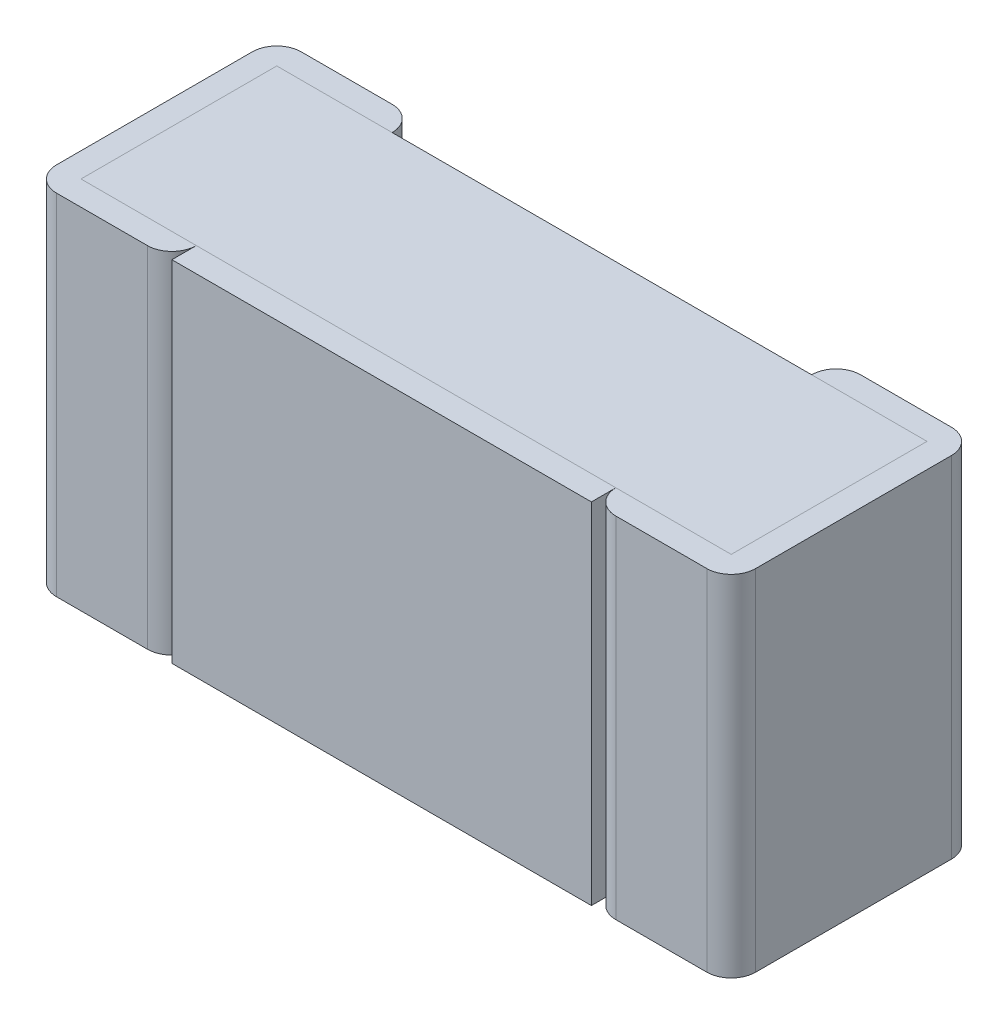
ISO-10303-21;
HEADER;
FILE_DESCRIPTION(('STEP AP214'),'2;1');
FILE_NAME('part.step','',(''),(''),'','','');
FILE_SCHEMA(('AUTOMOTIVE_DESIGN { 1 0 10303 214 1 1 1 1 }'));
ENDSEC;
DATA;
#1=APPLICATION_CONTEXT('core data for automotive mechanical design processes');
#2=APPLICATION_PROTOCOL_DEFINITION('international standard','automotive_design',2000,#1);
#3=PRODUCT_CONTEXT('',#1,'mechanical');
#4=PRODUCT('Part','Part','',(#3));
#5=PRODUCT_RELATED_PRODUCT_CATEGORY('part','',(#4));
#6=PRODUCT_DEFINITION_FORMATION('','',#4);
#7=PRODUCT_DEFINITION_CONTEXT('part definition',#1,'design');
#8=PRODUCT_DEFINITION('design','',#6,#7);
#9=PRODUCT_DEFINITION_SHAPE('','',#8);
#10=(LENGTH_UNIT() NAMED_UNIT(*) SI_UNIT(.MILLI.,.METRE.));
#11=(NAMED_UNIT(*) PLANE_ANGLE_UNIT() SI_UNIT($,.RADIAN.));
#12=(NAMED_UNIT(*) SI_UNIT($,.STERADIAN.) SOLID_ANGLE_UNIT());
#13=UNCERTAINTY_MEASURE_WITH_UNIT(LENGTH_MEASURE(1.E-05),#10,'distance_accuracy_value','');
#14=(GEOMETRIC_REPRESENTATION_CONTEXT(3) GLOBAL_UNCERTAINTY_ASSIGNED_CONTEXT((#13)) GLOBAL_UNIT_ASSIGNED_CONTEXT((#10,
#11,#12)) REPRESENTATION_CONTEXT('',''));
#15=CARTESIAN_POINT('',(0.,0.,0.));
#16=DIRECTION('',(0.,0.,1.));
#17=DIRECTION('',(1.,0.,0.));
#18=AXIS2_PLACEMENT_3D('',#15,#16,#17);
#19=CARTESIAN_POINT('',(-0.3,-0.25,0.35));
#20=DIRECTION('',(0.,0.,1.));
#21=DIRECTION('',(1.,0.,0.));
#22=AXIS2_PLACEMENT_3D('',#19,#20,#21);
#23=PLANE('',#22);
#24=DIRECTION('',(0.,1.,0.));
#25=VECTOR('',#24,1.);
#26=CARTESIAN_POINT('',(-0.3,-0.25,0.35));
#27=LINE('',#26,#25);
#28=CARTESIAN_POINT('',(-0.3,-0.25,0.35));
#29=VERTEX_POINT('',#28);
#30=CARTESIAN_POINT('',(-0.3,0.25,0.35));
#31=VERTEX_POINT('',#30);
#32=EDGE_CURVE('E253',#29,#31,#27,.T.);
#33=ORIENTED_EDGE('',*,*,#32,.F.);
#34=DIRECTION('',(1.,0.,0.));
#35=VECTOR('',#34,1.);
#36=CARTESIAN_POINT('',(-0.3,-0.25,0.35));
#37=LINE('',#36,#35);
#38=CARTESIAN_POINT('',(0.3,-0.25,0.35));
#39=VERTEX_POINT('',#38);
#40=EDGE_CURVE('E246',#29,#39,#37,.T.);
#41=ORIENTED_EDGE('',*,*,#40,.T.);
#42=DIRECTION('',(0.,1.,0.));
#43=VECTOR('',#42,1.);
#44=CARTESIAN_POINT('',(0.3,-0.25,0.35));
#45=LINE('',#44,#43);
#46=CARTESIAN_POINT('',(0.3,0.25,0.35));
#47=VERTEX_POINT('',#46);
#48=EDGE_CURVE('E11',#39,#47,#45,.T.);
#49=ORIENTED_EDGE('',*,*,#48,.T.);
#50=DIRECTION('',(1.,0.,0.));
#51=VECTOR('',#50,1.);
#52=CARTESIAN_POINT('',(-0.3,0.25,0.35));
#53=LINE('',#52,#51);
#54=EDGE_CURVE('E211',#31,#47,#53,.T.);
#55=ORIENTED_EDGE('',*,*,#54,.F.);
#56=EDGE_LOOP('',(#33,#41,#49,#55));
#57=FACE_BOUND('',#56,.T.);
#58=ADVANCED_FACE('F17',(#57),#23,.T.);
#59=CARTESIAN_POINT('',(0.3,-0.25,0.315));
#60=DIRECTION('',(1.,0.,0.));
#61=DIRECTION('',(0.,1.,0.));
#62=AXIS2_PLACEMENT_3D('',#59,#60,#61);
#63=PLANE('',#62);
#64=DIRECTION('',(0.,0.,1.));
#65=VECTOR('',#64,1.);
#66=CARTESIAN_POINT('',(0.3,-0.25,0.315));
#67=LINE('',#66,#65);
#68=CARTESIAN_POINT('',(0.3,-0.25,0.315));
#69=VERTEX_POINT('',#68);
#70=EDGE_CURVE('E238',#69,#39,#67,.T.);
#71=ORIENTED_EDGE('',*,*,#70,.F.);
#72=DIRECTION('',(0.,1.,0.));
#73=VECTOR('',#72,1.);
#74=CARTESIAN_POINT('',(0.3,-0.25,0.315));
#75=LINE('',#74,#73);
#76=CARTESIAN_POINT('',(0.3,0.25,0.315));
#77=VERTEX_POINT('',#76);
#78=EDGE_CURVE('E26',#69,#77,#75,.T.);
#79=ORIENTED_EDGE('',*,*,#78,.T.);
#80=DIRECTION('',(0.,0.,1.));
#81=VECTOR('',#80,1.);
#82=CARTESIAN_POINT('',(0.3,0.25,0.315));
#83=LINE('',#82,#81);
#84=EDGE_CURVE('E215',#77,#47,#83,.T.);
#85=ORIENTED_EDGE('',*,*,#84,.T.);
#86=ORIENTED_EDGE('',*,*,#48,.F.);
#87=EDGE_LOOP('',(#71,#79,#85,#86));
#88=FACE_BOUND('',#87,.T.);
#89=ADVANCED_FACE('F520',(#88),#63,.T.);
#90=CARTESIAN_POINT('',(0.335,-0.25,0.315));
#91=DIRECTION('',(0.,1.,0.));
#92=DIRECTION('',(-1.,0.,0.));
#93=AXIS2_PLACEMENT_3D('',#90,#91,#92);
#94=CYLINDRICAL_SURFACE('',#93,0.035);
#95=CARTESIAN_POINT('',(0.335,-0.25,0.315));
#96=DIRECTION('',(0.,1.,0.));
#97=DIRECTION('',(0.,0.,1.));
#98=AXIS2_PLACEMENT_3D('',#95,#96,#97);
#99=CIRCLE('',#98,0.035);
#100=CARTESIAN_POINT('',(0.335,-0.25,0.35));
#101=VERTEX_POINT('',#100);
#102=EDGE_CURVE('E223',#69,#101,#99,.T.);
#103=ORIENTED_EDGE('',*,*,#102,.T.);
#104=DIRECTION('',(0.,1.,0.));
#105=VECTOR('',#104,1.);
#106=CARTESIAN_POINT('',(0.335,-0.25,0.35));
#107=LINE('',#106,#105);
#108=CARTESIAN_POINT('',(0.335,0.25,0.35));
#109=VERTEX_POINT('',#108);
#110=EDGE_CURVE('E20',#101,#109,#107,.T.);
#111=ORIENTED_EDGE('',*,*,#110,.T.);
#112=CARTESIAN_POINT('',(0.335,0.25,0.315));
#113=DIRECTION('',(0.,1.,0.));
#114=DIRECTION('',(0.,0.,1.));
#115=AXIS2_PLACEMENT_3D('',#112,#113,#114);
#116=CIRCLE('',#115,0.035);
#117=EDGE_CURVE('E153',#77,#109,#116,.T.);
#118=ORIENTED_EDGE('',*,*,#117,.F.);
#119=ORIENTED_EDGE('',*,*,#78,.F.);
#120=EDGE_LOOP('',(#103,#111,#118,#119));
#121=FACE_BOUND('',#120,.T.);
#122=ADVANCED_FACE('F525',(#121),#94,.T.);
#123=CARTESIAN_POINT('',(0.3,-0.25,0.35));
#124=DIRECTION('',(0.,0.,1.));
#125=DIRECTION('',(1.,0.,0.));
#126=AXIS2_PLACEMENT_3D('',#123,#124,#125);
#127=PLANE('',#126);
#128=DIRECTION('',(1.,0.,0.));
#129=VECTOR('',#128,1.);
#130=CARTESIAN_POINT('',(0.3,0.25,0.35));
#131=LINE('',#130,#129);
#132=CARTESIAN_POINT('',(0.465,0.25,0.35));
#133=VERTEX_POINT('',#132);
#134=EDGE_CURVE('E132',#109,#133,#131,.T.);
#135=ORIENTED_EDGE('',*,*,#134,.F.);
#136=ORIENTED_EDGE('',*,*,#110,.F.);
#137=DIRECTION('',(1.,0.,0.));
#138=VECTOR('',#137,1.);
#139=CARTESIAN_POINT('',(0.3,-0.25,0.35));
#140=LINE('',#139,#138);
#141=CARTESIAN_POINT('',(0.465,-0.25,0.35));
#142=VERTEX_POINT('',#141);
#143=EDGE_CURVE('E135',#101,#142,#140,.T.);
#144=ORIENTED_EDGE('',*,*,#143,.T.);
#145=DIRECTION('',(0.,1.,0.));
#146=VECTOR('',#145,1.);
#147=CARTESIAN_POINT('',(0.465,-0.25,0.35));
#148=LINE('',#147,#146);
#149=EDGE_CURVE('E128',#142,#133,#148,.T.);
#150=ORIENTED_EDGE('',*,*,#149,.T.);
#151=EDGE_LOOP('',(#135,#136,#144,#150));
#152=FACE_BOUND('',#151,.T.);
#153=ADVANCED_FACE('F130',(#152),#127,.T.);
#154=CARTESIAN_POINT('',(0.465,-0.25,0.315));
#155=DIRECTION('',(0.,1.,0.));
#156=DIRECTION('',(1.,0.,0.));
#157=AXIS2_PLACEMENT_3D('',#154,#155,#156);
#158=CYLINDRICAL_SURFACE('',#157,0.035);
#159=DIRECTION('',(0.,1.,0.));
#160=VECTOR('',#159,1.);
#161=CARTESIAN_POINT('',(0.5,-0.25,0.315));
#162=LINE('',#161,#160);
#163=CARTESIAN_POINT('',(0.5,-0.25,0.315));
#164=VERTEX_POINT('',#163);
#165=CARTESIAN_POINT('',(0.5,0.25,0.315));
#166=VERTEX_POINT('',#165);
#167=EDGE_CURVE('E140',#164,#166,#162,.T.);
#168=ORIENTED_EDGE('',*,*,#167,.T.);
#169=CARTESIAN_POINT('',(0.465,0.25,0.315));
#170=DIRECTION('',(0.,-1.,0.));
#171=DIRECTION('',(0.,0.,1.));
#172=AXIS2_PLACEMENT_3D('',#169,#170,#171);
#173=CIRCLE('',#172,0.035);
#174=EDGE_CURVE('E142',#166,#133,#173,.T.);
#175=ORIENTED_EDGE('',*,*,#174,.T.);
#176=ORIENTED_EDGE('',*,*,#149,.F.);
#177=CARTESIAN_POINT('',(0.465,-0.25,0.315));
#178=DIRECTION('',(0.,-1.,0.));
#179=DIRECTION('',(0.,0.,1.));
#180=AXIS2_PLACEMENT_3D('',#177,#178,#179);
#181=CIRCLE('',#180,0.035);
#182=EDGE_CURVE('E224',#164,#142,#181,.T.);
#183=ORIENTED_EDGE('',*,*,#182,.F.);
#184=EDGE_LOOP('',(#168,#175,#176,#183));
#185=FACE_BOUND('',#184,.T.);
#186=ADVANCED_FACE('F143',(#185),#158,.T.);
#187=CARTESIAN_POINT('',(0.5,-0.25,0.));
#188=DIRECTION('',(1.,0.,0.));
#189=DIRECTION('',(0.,1.,0.));
#190=AXIS2_PLACEMENT_3D('',#187,#188,#189);
#191=PLANE('',#190);
#192=DIRECTION('',(0.,0.,1.));
#193=VECTOR('',#192,1.);
#194=CARTESIAN_POINT('',(0.5,-0.25,0.));
#195=LINE('',#194,#193);
#196=CARTESIAN_POINT('',(0.5,-0.25,0.035));
#197=VERTEX_POINT('',#196);
#198=EDGE_CURVE('E220',#197,#164,#195,.T.);
#199=ORIENTED_EDGE('',*,*,#198,.F.);
#200=DIRECTION('',(0.,1.,0.));
#201=VECTOR('',#200,1.);
#202=CARTESIAN_POINT('',(0.5,-0.25,0.035));
#203=LINE('',#202,#201);
#204=CARTESIAN_POINT('',(0.5,0.25,0.035));
#205=VERTEX_POINT('',#204);
#206=EDGE_CURVE('E50',#197,#205,#203,.T.);
#207=ORIENTED_EDGE('',*,*,#206,.T.);
#208=DIRECTION('',(0.,0.,1.));
#209=VECTOR('',#208,1.);
#210=CARTESIAN_POINT('',(0.5,0.25,0.));
#211=LINE('',#210,#209);
#212=EDGE_CURVE('E147',#205,#166,#211,.T.);
#213=ORIENTED_EDGE('',*,*,#212,.T.);
#214=ORIENTED_EDGE('',*,*,#167,.F.);
#215=EDGE_LOOP('',(#199,#207,#213,#214));
#216=FACE_BOUND('',#215,.T.);
#217=ADVANCED_FACE('F508',(#216),#191,.T.);
#218=CARTESIAN_POINT('',(0.465,-0.25,0.035));
#219=DIRECTION('',(0.,1.,0.));
#220=DIRECTION('',(1.,0.,0.));
#221=AXIS2_PLACEMENT_3D('',#218,#219,#220);
#222=CYLINDRICAL_SURFACE('',#221,0.035);
#223=CARTESIAN_POINT('',(0.465,-0.25,0.035));
#224=DIRECTION('',(0.,1.,0.));
#225=DIRECTION('',(0.,0.,1.));
#226=AXIS2_PLACEMENT_3D('',#223,#224,#225);
#227=CIRCLE('',#226,0.035);
#228=CARTESIAN_POINT('',(0.465,-0.25,0.));
#229=VERTEX_POINT('',#228);
#230=EDGE_CURVE('E210',#197,#229,#227,.T.);
#231=ORIENTED_EDGE('',*,*,#230,.T.);
#232=DIRECTION('',(0.,1.,0.));
#233=VECTOR('',#232,1.);
#234=CARTESIAN_POINT('',(0.465,-0.25,0.));
#235=LINE('',#234,#233);
#236=CARTESIAN_POINT('',(0.465,0.25,0.));
#237=VERTEX_POINT('',#236);
#238=EDGE_CURVE('E242',#229,#237,#235,.T.);
#239=ORIENTED_EDGE('',*,*,#238,.T.);
#240=CARTESIAN_POINT('',(0.465,0.25,0.035));
#241=DIRECTION('',(0.,1.,0.));
#242=DIRECTION('',(0.,0.,1.));
#243=AXIS2_PLACEMENT_3D('',#240,#241,#242);
#244=CIRCLE('',#243,0.035);
#245=EDGE_CURVE('E216',#205,#237,#244,.T.);
#246=ORIENTED_EDGE('',*,*,#245,.F.);
#247=ORIENTED_EDGE('',*,*,#206,.F.);
#248=EDGE_LOOP('',(#231,#239,#246,#247));
#249=FACE_BOUND('',#248,.T.);
#250=ADVANCED_FACE('F507',(#249),#222,.T.);
#251=CARTESIAN_POINT('',(0.3,-0.25,0.));
#252=DIRECTION('',(0.,0.,1.));
#253=DIRECTION('',(1.,0.,0.));
#254=AXIS2_PLACEMENT_3D('',#251,#252,#253);
#255=PLANE('',#254);
#256=ORIENTED_EDGE('',*,*,#238,.F.);
#257=DIRECTION('',(1.,0.,0.));
#258=VECTOR('',#257,1.);
#259=CARTESIAN_POINT('',(0.3,-0.25,0.));
#260=LINE('',#259,#258);
#261=CARTESIAN_POINT('',(0.335,-0.25,0.));
#262=VERTEX_POINT('',#261);
#263=EDGE_CURVE('E234',#262,#229,#260,.T.);
#264=ORIENTED_EDGE('',*,*,#263,.F.);
#265=DIRECTION('',(0.,1.,0.));
#266=VECTOR('',#265,1.);
#267=CARTESIAN_POINT('',(0.335,-0.25,0.));
#268=LINE('',#267,#266);
#269=CARTESIAN_POINT('',(0.335,0.25,0.));
#270=VERTEX_POINT('',#269);
#271=EDGE_CURVE('E239',#262,#270,#268,.T.);
#272=ORIENTED_EDGE('',*,*,#271,.T.);
#273=DIRECTION('',(1.,0.,0.));
#274=VECTOR('',#273,1.);
#275=CARTESIAN_POINT('',(0.3,0.25,0.));
#276=LINE('',#275,#274);
#277=EDGE_CURVE('E261',#270,#237,#276,.T.);
#278=ORIENTED_EDGE('',*,*,#277,.T.);
#279=EDGE_LOOP('',(#256,#264,#272,#278));
#280=FACE_BOUND('',#279,.T.);
#281=ADVANCED_FACE('F505',(#280),#255,.F.);
#282=CARTESIAN_POINT('',(0.335,-0.25,0.035));
#283=DIRECTION('',(0.,1.,0.));
#284=DIRECTION('',(-1.,0.,0.));
#285=AXIS2_PLACEMENT_3D('',#282,#283,#284);
#286=CYLINDRICAL_SURFACE('',#285,0.035);
#287=DIRECTION('',(0.,1.,0.));
#288=VECTOR('',#287,1.);
#289=CARTESIAN_POINT('',(0.3,-0.25,0.035));
#290=LINE('',#289,#288);
#291=CARTESIAN_POINT('',(0.3,-0.25,0.035));
#292=VERTEX_POINT('',#291);
#293=CARTESIAN_POINT('',(0.3,0.25,0.035));
#294=VERTEX_POINT('',#293);
#295=EDGE_CURVE('E195',#292,#294,#290,.T.);
#296=ORIENTED_EDGE('',*,*,#295,.T.);
#297=CARTESIAN_POINT('',(0.335,0.25,0.035));
#298=DIRECTION('',(0.,-1.,0.));
#299=DIRECTION('',(0.,0.,1.));
#300=AXIS2_PLACEMENT_3D('',#297,#298,#299);
#301=CIRCLE('',#300,0.035);
#302=EDGE_CURVE('E160',#294,#270,#301,.T.);
#303=ORIENTED_EDGE('',*,*,#302,.T.);
#304=ORIENTED_EDGE('',*,*,#271,.F.);
#305=CARTESIAN_POINT('',(0.335,-0.25,0.035));
#306=DIRECTION('',(0.,-1.,0.));
#307=DIRECTION('',(0.,0.,1.));
#308=AXIS2_PLACEMENT_3D('',#305,#306,#307);
#309=CIRCLE('',#308,0.035);
#310=EDGE_CURVE('E230',#292,#262,#309,.T.);
#311=ORIENTED_EDGE('',*,*,#310,.F.);
#312=EDGE_LOOP('',(#296,#303,#304,#311));
#313=FACE_BOUND('',#312,.T.);
#314=ADVANCED_FACE('F497',(#313),#286,.T.);
#315=CARTESIAN_POINT('',(-0.3,0.25,0.315));
#316=DIRECTION('',(0.,1.,0.));
#317=DIRECTION('',(1.,0.,0.));
#318=AXIS2_PLACEMENT_3D('',#315,#316,#317);
#319=PLANE('',#318);
#320=DIRECTION('',(1.,0.,0.));
#321=VECTOR('',#320,1.);
#322=CARTESIAN_POINT('',(-0.3,0.25,0.315));
#323=LINE('',#322,#321);
#324=CARTESIAN_POINT('',(-0.3,0.25,0.315));
#325=VERTEX_POINT('',#324);
#326=EDGE_CURVE('E202',#325,#77,#323,.T.);
#327=ORIENTED_EDGE('',*,*,#326,.F.);
#328=DIRECTION('',(0.,0.,1.));
#329=VECTOR('',#328,1.);
#330=CARTESIAN_POINT('',(-0.3,0.25,0.315));
#331=LINE('',#330,#329);
#332=EDGE_CURVE('E257',#325,#31,#331,.T.);
#333=ORIENTED_EDGE('',*,*,#332,.T.);
#334=ORIENTED_EDGE('',*,*,#54,.T.);
#335=ORIENTED_EDGE('',*,*,#84,.F.);
#336=EDGE_LOOP('',(#327,#333,#334,#335));
#337=FACE_BOUND('',#336,.T.);
#338=ADVANCED_FACE('F538',(#337),#319,.T.);
#339=CARTESIAN_POINT('',(0.3,0.25,0.));
#340=DIRECTION('',(0.,1.,0.));
#341=DIRECTION('',(1.,0.,0.));
#342=AXIS2_PLACEMENT_3D('',#339,#340,#341);
#343=PLANE('',#342);
#344=ORIENTED_EDGE('',*,*,#277,.F.);
#345=ORIENTED_EDGE('',*,*,#302,.F.);
#346=DIRECTION('',(1.,0.,0.));
#347=VECTOR('',#346,1.);
#348=CARTESIAN_POINT('',(-0.465,0.25,0.035));
#349=LINE('',#348,#347);
#350=CARTESIAN_POINT('',(0.465,0.25,0.035));
#351=VERTEX_POINT('',#350);
#352=EDGE_CURVE('E196',#294,#351,#349,.T.);
#353=ORIENTED_EDGE('',*,*,#352,.T.);
#354=DIRECTION('',(0.,0.,1.));
#355=VECTOR('',#354,1.);
#356=CARTESIAN_POINT('',(0.465,0.25,0.035));
#357=LINE('',#356,#355);
#358=CARTESIAN_POINT('',(0.465,0.25,0.315));
#359=VERTEX_POINT('',#358);
#360=EDGE_CURVE('E201',#351,#359,#357,.T.);
#361=ORIENTED_EDGE('',*,*,#360,.T.);
#362=DIRECTION('',(1.,0.,0.));
#363=VECTOR('',#362,1.);
#364=CARTESIAN_POINT('',(-0.465,0.25,0.315));
#365=LINE('',#364,#363);
#366=EDGE_CURVE('E197',#77,#359,#365,.T.);
#367=ORIENTED_EDGE('',*,*,#366,.F.);
#368=ORIENTED_EDGE('',*,*,#117,.T.);
#369=ORIENTED_EDGE('',*,*,#134,.T.);
#370=ORIENTED_EDGE('',*,*,#174,.F.);
#371=ORIENTED_EDGE('',*,*,#212,.F.);
#372=ORIENTED_EDGE('',*,*,#245,.T.);
#373=EDGE_LOOP('',(#344,#345,#353,#361,#367,#368,#369,#370,#371,#372));
#374=FACE_BOUND('',#373,.T.);
#375=ADVANCED_FACE('F150',(#374),#343,.T.);
#376=CARTESIAN_POINT('',(-0.3,-0.25,0.315));
#377=DIRECTION('',(1.,0.,0.));
#378=DIRECTION('',(0.,1.,0.));
#379=AXIS2_PLACEMENT_3D('',#376,#377,#378);
#380=PLANE('',#379);
#381=ORIENTED_EDGE('',*,*,#32,.T.);
#382=ORIENTED_EDGE('',*,*,#332,.F.);
#383=DIRECTION('',(0.,1.,0.));
#384=VECTOR('',#383,1.);
#385=CARTESIAN_POINT('',(-0.3,-0.25,0.315));
#386=LINE('',#385,#384);
#387=CARTESIAN_POINT('',(-0.3,-0.25,0.315));
#388=VERTEX_POINT('',#387);
#389=EDGE_CURVE('E190',#388,#325,#386,.T.);
#390=ORIENTED_EDGE('',*,*,#389,.F.);
#391=DIRECTION('',(0.,0.,1.));
#392=VECTOR('',#391,1.);
#393=CARTESIAN_POINT('',(-0.3,-0.25,0.315));
#394=LINE('',#393,#392);
#395=EDGE_CURVE('E249',#388,#29,#394,.T.);
#396=ORIENTED_EDGE('',*,*,#395,.T.);
#397=EDGE_LOOP('',(#381,#382,#390,#396));
#398=FACE_BOUND('',#397,.T.);
#399=ADVANCED_FACE('F531',(#398),#380,.F.);
#400=CARTESIAN_POINT('',(-0.3,-0.25,0.315));
#401=DIRECTION('',(0.,1.,0.));
#402=DIRECTION('',(1.,0.,0.));
#403=AXIS2_PLACEMENT_3D('',#400,#401,#402);
#404=PLANE('',#403);
#405=ORIENTED_EDGE('',*,*,#70,.T.);
#406=ORIENTED_EDGE('',*,*,#40,.F.);
#407=ORIENTED_EDGE('',*,*,#395,.F.);
#408=DIRECTION('',(1.,0.,0.));
#409=VECTOR('',#408,1.);
#410=CARTESIAN_POINT('',(-0.3,-0.25,0.315));
#411=LINE('',#410,#409);
#412=EDGE_CURVE('E182',#388,#69,#411,.T.);
#413=ORIENTED_EDGE('',*,*,#412,.T.);
#414=EDGE_LOOP('',(#405,#406,#407,#413));
#415=FACE_BOUND('',#414,.T.);
#416=ADVANCED_FACE('F533',(#415),#404,.F.);
#417=CARTESIAN_POINT('',(0.3,-0.25,0.));
#418=DIRECTION('',(0.,1.,0.));
#419=DIRECTION('',(1.,0.,0.));
#420=AXIS2_PLACEMENT_3D('',#417,#418,#419);
#421=PLANE('',#420);
#422=ORIENTED_EDGE('',*,*,#230,.F.);
#423=ORIENTED_EDGE('',*,*,#198,.T.);
#424=ORIENTED_EDGE('',*,*,#182,.T.);
#425=ORIENTED_EDGE('',*,*,#143,.F.);
#426=ORIENTED_EDGE('',*,*,#102,.F.);
#427=DIRECTION('',(1.,0.,0.));
#428=VECTOR('',#427,1.);
#429=CARTESIAN_POINT('',(-0.465,-0.25,0.315));
#430=LINE('',#429,#428);
#431=CARTESIAN_POINT('',(0.465,-0.25,0.315));
#432=VERTEX_POINT('',#431);
#433=EDGE_CURVE('E174',#69,#432,#430,.T.);
#434=ORIENTED_EDGE('',*,*,#433,.T.);
#435=DIRECTION('',(0.,0.,1.));
#436=VECTOR('',#435,1.);
#437=CARTESIAN_POINT('',(0.465,-0.25,0.035));
#438=LINE('',#437,#436);
#439=CARTESIAN_POINT('',(0.465,-0.25,0.035));
#440=VERTEX_POINT('',#439);
#441=EDGE_CURVE('E170',#440,#432,#438,.T.);
#442=ORIENTED_EDGE('',*,*,#441,.F.);
#443=DIRECTION('',(1.,0.,0.));
#444=VECTOR('',#443,1.);
#445=CARTESIAN_POINT('',(-0.465,-0.25,0.035));
#446=LINE('',#445,#444);
#447=EDGE_CURVE('E175',#292,#440,#446,.T.);
#448=ORIENTED_EDGE('',*,*,#447,.F.);
#449=ORIENTED_EDGE('',*,*,#310,.T.);
#450=ORIENTED_EDGE('',*,*,#263,.T.);
#451=EDGE_LOOP('',(#422,#423,#424,#425,#426,#434,#442,#448,#449,#450));
#452=FACE_BOUND('',#451,.T.);
#453=ADVANCED_FACE('F492',(#452),#421,.F.);
#454=CARTESIAN_POINT('',(-0.465,-0.25,0.035));
#455=DIRECTION('',(0.,0.,1.));
#456=DIRECTION('',(1.,0.,0.));
#457=AXIS2_PLACEMENT_3D('',#454,#455,#456);
#458=PLANE('',#457);
#459=DIRECTION('',(1.,0.,0.));
#460=VECTOR('',#459,1.);
#461=CARTESIAN_POINT('',(-0.465,0.25,0.035));
#462=LINE('',#461,#460);
#463=CARTESIAN_POINT('',(-0.3,0.25,0.035));
#464=VERTEX_POINT('',#463);
#465=EDGE_CURVE('E191',#464,#294,#462,.T.);
#466=ORIENTED_EDGE('',*,*,#465,.T.);
#467=ORIENTED_EDGE('',*,*,#295,.F.);
#468=DIRECTION('',(1.,0.,0.));
#469=VECTOR('',#468,1.);
#470=CARTESIAN_POINT('',(-0.465,-0.25,0.035));
#471=LINE('',#470,#469);
#472=CARTESIAN_POINT('',(-0.3,-0.25,0.035));
#473=VERTEX_POINT('',#472);
#474=EDGE_CURVE('E169',#473,#292,#471,.T.);
#475=ORIENTED_EDGE('',*,*,#474,.F.);
#476=DIRECTION('',(0.,1.,0.));
#477=VECTOR('',#476,1.);
#478=CARTESIAN_POINT('',(-0.3,-0.25,0.035));
#479=LINE('',#478,#477);
#480=EDGE_CURVE('E166',#473,#464,#479,.T.);
#481=ORIENTED_EDGE('',*,*,#480,.T.);
#482=EDGE_LOOP('',(#466,#467,#475,#481));
#483=FACE_BOUND('',#482,.T.);
#484=ADVANCED_FACE('F499',(#483),#458,.F.);
#485=CARTESIAN_POINT('',(-0.465,0.25,0.035));
#486=DIRECTION('',(0.,1.,0.));
#487=DIRECTION('',(1.,0.,0.));
#488=AXIS2_PLACEMENT_3D('',#485,#486,#487);
#489=PLANE('',#488);
#490=DIRECTION('',(1.,0.,0.));
#491=VECTOR('',#490,1.);
#492=CARTESIAN_POINT('',(-0.465,0.25,0.035));
#493=LINE('',#492,#491);
#494=CARTESIAN_POINT('',(-0.465,0.25,0.035));
#495=VERTEX_POINT('',#494);
#496=EDGE_CURVE('E364',#495,#464,#493,.T.);
#497=ORIENTED_EDGE('',*,*,#496,.F.);
#498=DIRECTION('',(0.,0.,1.));
#499=VECTOR('',#498,1.);
#500=CARTESIAN_POINT('',(-0.465,0.25,0.035));
#501=LINE('',#500,#499);
#502=CARTESIAN_POINT('',(-0.465,0.25,0.315));
#503=VERTEX_POINT('',#502);
#504=EDGE_CURVE('E360',#495,#503,#501,.T.);
#505=ORIENTED_EDGE('',*,*,#504,.T.);
#506=DIRECTION('',(1.,0.,0.));
#507=VECTOR('',#506,1.);
#508=CARTESIAN_POINT('',(-0.465,0.25,0.315));
#509=LINE('',#508,#507);
#510=EDGE_CURVE('E322',#503,#325,#509,.T.);
#511=ORIENTED_EDGE('',*,*,#510,.T.);
#512=ORIENTED_EDGE('',*,*,#326,.T.);
#513=ORIENTED_EDGE('',*,*,#366,.T.);
#514=ORIENTED_EDGE('',*,*,#360,.F.);
#515=ORIENTED_EDGE('',*,*,#352,.F.);
#516=ORIENTED_EDGE('',*,*,#465,.F.);
#517=EDGE_LOOP('',(#497,#505,#511,#512,#513,#514,#515,#516));
#518=FACE_BOUND('',#517,.T.);
#519=ADVANCED_FACE('F503',(#518),#489,.T.);
#520=CARTESIAN_POINT('',(-0.335,-0.25,0.315));
#521=DIRECTION('',(0.,1.,0.));
#522=DIRECTION('',(1.,0.,0.));
#523=AXIS2_PLACEMENT_3D('',#520,#521,#522);
#524=CYLINDRICAL_SURFACE('',#523,0.035);
#525=ORIENTED_EDGE('',*,*,#389,.T.);
#526=CARTESIAN_POINT('',(-0.335,0.25,0.315));
#527=DIRECTION('',(0.,-1.,0.));
#528=DIRECTION('',(0.,0.,1.));
#529=AXIS2_PLACEMENT_3D('',#526,#527,#528);
#530=CIRCLE('',#529,0.035);
#531=CARTESIAN_POINT('',(-0.335,0.25,0.35));
#532=VERTEX_POINT('',#531);
#533=EDGE_CURVE('E318',#325,#532,#530,.T.);
#534=ORIENTED_EDGE('',*,*,#533,.T.);
#535=DIRECTION('',(0.,1.,0.));
#536=VECTOR('',#535,1.);
#537=CARTESIAN_POINT('',(-0.335,-0.25,0.35));
#538=LINE('',#537,#536);
#539=CARTESIAN_POINT('',(-0.335,-0.25,0.35));
#540=VERTEX_POINT('',#539);
#541=EDGE_CURVE('E186',#540,#532,#538,.T.);
#542=ORIENTED_EDGE('',*,*,#541,.F.);
#543=CARTESIAN_POINT('',(-0.335,-0.25,0.315));
#544=DIRECTION('',(0.,-1.,0.));
#545=DIRECTION('',(0.,0.,1.));
#546=AXIS2_PLACEMENT_3D('',#543,#544,#545);
#547=CIRCLE('',#546,0.035);
#548=EDGE_CURVE('E312',#388,#540,#547,.T.);
#549=ORIENTED_EDGE('',*,*,#548,.F.);
#550=EDGE_LOOP('',(#525,#534,#542,#549));
#551=FACE_BOUND('',#550,.T.);
#552=ADVANCED_FACE('F541',(#551),#524,.T.);
#553=CARTESIAN_POINT('',(-0.5,-0.25,0.35));
#554=DIRECTION('',(0.,0.,1.));
#555=DIRECTION('',(1.,0.,0.));
#556=AXIS2_PLACEMENT_3D('',#553,#554,#555);
#557=PLANE('',#556);
#558=DIRECTION('',(1.,0.,0.));
#559=VECTOR('',#558,1.);
#560=CARTESIAN_POINT('',(-0.5,0.25,0.35));
#561=LINE('',#560,#559);
#562=CARTESIAN_POINT('',(-0.465,0.25,0.35));
#563=VERTEX_POINT('',#562);
#564=EDGE_CURVE('E323',#563,#532,#561,.T.);
#565=ORIENTED_EDGE('',*,*,#564,.F.);
#566=DIRECTION('',(0.,1.,0.));
#567=VECTOR('',#566,1.);
#568=CARTESIAN_POINT('',(-0.465,-0.25,0.35));
#569=LINE('',#568,#567);
#570=CARTESIAN_POINT('',(-0.465,-0.25,0.35));
#571=VERTEX_POINT('',#570);
#572=EDGE_CURVE('E297',#571,#563,#569,.T.);
#573=ORIENTED_EDGE('',*,*,#572,.F.);
#574=DIRECTION('',(1.,0.,0.));
#575=VECTOR('',#574,1.);
#576=CARTESIAN_POINT('',(-0.5,-0.25,0.35));
#577=LINE('',#576,#575);
#578=EDGE_CURVE('E331',#571,#540,#577,.T.);
#579=ORIENTED_EDGE('',*,*,#578,.T.);
#580=ORIENTED_EDGE('',*,*,#541,.T.);
#581=EDGE_LOOP('',(#565,#573,#579,#580));
#582=FACE_BOUND('',#581,.T.);
#583=ADVANCED_FACE('F552',(#582),#557,.T.);
#584=CARTESIAN_POINT('',(-0.465,-0.25,0.035));
#585=DIRECTION('',(0.,1.,0.));
#586=DIRECTION('',(1.,0.,0.));
#587=AXIS2_PLACEMENT_3D('',#584,#585,#586);
#588=PLANE('',#587);
#589=ORIENTED_EDGE('',*,*,#474,.T.);
#590=ORIENTED_EDGE('',*,*,#447,.T.);
#591=ORIENTED_EDGE('',*,*,#441,.T.);
#592=ORIENTED_EDGE('',*,*,#433,.F.);
#593=ORIENTED_EDGE('',*,*,#412,.F.);
#594=DIRECTION('',(1.,0.,0.));
#595=VECTOR('',#594,1.);
#596=CARTESIAN_POINT('',(-0.465,-0.25,0.315));
#597=LINE('',#596,#595);
#598=CARTESIAN_POINT('',(-0.465,-0.25,0.315));
#599=VERTEX_POINT('',#598);
#600=EDGE_CURVE('E309',#599,#388,#597,.T.);
#601=ORIENTED_EDGE('',*,*,#600,.F.);
#602=DIRECTION('',(0.,0.,1.));
#603=VECTOR('',#602,1.);
#604=CARTESIAN_POINT('',(-0.465,-0.25,0.035));
#605=LINE('',#604,#603);
#606=CARTESIAN_POINT('',(-0.465,-0.25,0.035));
#607=VERTEX_POINT('',#606);
#608=EDGE_CURVE('E313',#607,#599,#605,.T.);
#609=ORIENTED_EDGE('',*,*,#608,.F.);
#610=DIRECTION('',(1.,0.,0.));
#611=VECTOR('',#610,1.);
#612=CARTESIAN_POINT('',(-0.465,-0.25,0.035));
#613=LINE('',#612,#611);
#614=EDGE_CURVE('E327',#607,#473,#613,.T.);
#615=ORIENTED_EDGE('',*,*,#614,.T.);
#616=EDGE_LOOP('',(#589,#590,#591,#592,#593,#601,#609,#615));
#617=FACE_BOUND('',#616,.T.);
#618=ADVANCED_FACE('F445',(#617),#588,.F.);
#619=CARTESIAN_POINT('',(-0.335,-0.25,0.035));
#620=DIRECTION('',(0.,1.,0.));
#621=DIRECTION('',(1.,0.,0.));
#622=AXIS2_PLACEMENT_3D('',#619,#620,#621);
#623=CYLINDRICAL_SURFACE('',#622,0.035);
#624=CARTESIAN_POINT('',(-0.335,-0.25,0.035));
#625=DIRECTION('',(0.,1.,0.));
#626=DIRECTION('',(0.,0.,1.));
#627=AXIS2_PLACEMENT_3D('',#624,#625,#626);
#628=CIRCLE('',#627,0.035);
#629=CARTESIAN_POINT('',(-0.335,-0.25,0.));
#630=VERTEX_POINT('',#629);
#631=EDGE_CURVE('E308',#473,#630,#628,.T.);
#632=ORIENTED_EDGE('',*,*,#631,.T.);
#633=DIRECTION('',(0.,1.,0.));
#634=VECTOR('',#633,1.);
#635=CARTESIAN_POINT('',(-0.335,-0.25,0.));
#636=LINE('',#635,#634);
#637=CARTESIAN_POINT('',(-0.335,0.25,0.));
#638=VERTEX_POINT('',#637);
#639=EDGE_CURVE('E164',#630,#638,#636,.T.);
#640=ORIENTED_EDGE('',*,*,#639,.T.);
#641=CARTESIAN_POINT('',(-0.335,0.25,0.035));
#642=DIRECTION('',(0.,1.,0.));
#643=DIRECTION('',(0.,0.,1.));
#644=AXIS2_PLACEMENT_3D('',#641,#642,#643);
#645=CIRCLE('',#644,0.035);
#646=EDGE_CURVE('E367',#464,#638,#645,.T.);
#647=ORIENTED_EDGE('',*,*,#646,.F.);
#648=ORIENTED_EDGE('',*,*,#480,.F.);
#649=EDGE_LOOP('',(#632,#640,#647,#648));
#650=FACE_BOUND('',#649,.T.);
#651=ADVANCED_FACE('F380',(#650),#623,.T.);
#652=CARTESIAN_POINT('',(-0.5,-0.25,0.));
#653=DIRECTION('',(0.,0.,1.));
#654=DIRECTION('',(1.,0.,0.));
#655=AXIS2_PLACEMENT_3D('',#652,#653,#654);
#656=PLANE('',#655);
#657=ORIENTED_EDGE('',*,*,#639,.F.);
#658=DIRECTION('',(1.,0.,0.));
#659=VECTOR('',#658,1.);
#660=CARTESIAN_POINT('',(-0.5,-0.25,0.));
#661=LINE('',#660,#659);
#662=CARTESIAN_POINT('',(-0.465,-0.25,0.));
#663=VERTEX_POINT('',#662);
#664=EDGE_CURVE('E332',#663,#630,#661,.T.);
#665=ORIENTED_EDGE('',*,*,#664,.F.);
#666=DIRECTION('',(0.,1.,0.));
#667=VECTOR('',#666,1.);
#668=CARTESIAN_POINT('',(-0.465,-0.25,0.));
#669=LINE('',#668,#667);
#670=CARTESIAN_POINT('',(-0.465,0.25,0.));
#671=VERTEX_POINT('',#670);
#672=EDGE_CURVE('E293',#663,#671,#669,.T.);
#673=ORIENTED_EDGE('',*,*,#672,.T.);
#674=DIRECTION('',(1.,0.,0.));
#675=VECTOR('',#674,1.);
#676=CARTESIAN_POINT('',(-0.5,0.25,0.));
#677=LINE('',#676,#675);
#678=EDGE_CURVE('E347',#671,#638,#677,.T.);
#679=ORIENTED_EDGE('',*,*,#678,.T.);
#680=EDGE_LOOP('',(#657,#665,#673,#679));
#681=FACE_BOUND('',#680,.T.);
#682=ADVANCED_FACE('F391',(#681),#656,.F.);
#683=CARTESIAN_POINT('',(-0.5,0.25,0.));
#684=DIRECTION('',(0.,1.,0.));
#685=DIRECTION('',(1.,0.,0.));
#686=AXIS2_PLACEMENT_3D('',#683,#684,#685);
#687=PLANE('',#686);
#688=ORIENTED_EDGE('',*,*,#678,.F.);
#689=CARTESIAN_POINT('',(-0.465,0.25,0.035));
#690=DIRECTION('',(0.,-1.,0.));
#691=DIRECTION('',(0.,0.,1.));
#692=AXIS2_PLACEMENT_3D('',#689,#690,#691);
#693=CIRCLE('',#692,0.035);
#694=CARTESIAN_POINT('',(-0.5,0.25,0.035));
#695=VERTEX_POINT('',#694);
#696=EDGE_CURVE('E298',#695,#671,#693,.T.);
#697=ORIENTED_EDGE('',*,*,#696,.F.);
#698=DIRECTION('',(0.,0.,1.));
#699=VECTOR('',#698,1.);
#700=CARTESIAN_POINT('',(-0.5,0.25,0.));
#701=LINE('',#700,#699);
#702=CARTESIAN_POINT('',(-0.5,0.25,0.315));
#703=VERTEX_POINT('',#702);
#704=EDGE_CURVE('E289',#695,#703,#701,.T.);
#705=ORIENTED_EDGE('',*,*,#704,.T.);
#706=CARTESIAN_POINT('',(-0.465,0.25,0.315));
#707=DIRECTION('',(0.,1.,0.));
#708=DIRECTION('',(0.,0.,1.));
#709=AXIS2_PLACEMENT_3D('',#706,#707,#708);
#710=CIRCLE('',#709,0.035);
#711=EDGE_CURVE('E340',#703,#563,#710,.T.);
#712=ORIENTED_EDGE('',*,*,#711,.T.);
#713=ORIENTED_EDGE('',*,*,#564,.T.);
#714=ORIENTED_EDGE('',*,*,#533,.F.);
#715=ORIENTED_EDGE('',*,*,#510,.F.);
#716=ORIENTED_EDGE('',*,*,#504,.F.);
#717=ORIENTED_EDGE('',*,*,#496,.T.);
#718=ORIENTED_EDGE('',*,*,#646,.T.);
#719=EDGE_LOOP('',(#688,#697,#705,#712,#713,#714,#715,#716,#717,#718));
#720=FACE_BOUND('',#719,.T.);
#721=ADVANCED_FACE('F546',(#720),#687,.T.);
#722=CARTESIAN_POINT('',(-0.465,-0.25,0.315));
#723=DIRECTION('',(0.,1.,0.));
#724=DIRECTION('',(-1.,0.,0.));
#725=AXIS2_PLACEMENT_3D('',#722,#723,#724);
#726=CYLINDRICAL_SURFACE('',#725,0.035);
#727=CARTESIAN_POINT('',(-0.465,-0.25,0.315));
#728=DIRECTION('',(0.,1.,0.));
#729=DIRECTION('',(0.,0.,1.));
#730=AXIS2_PLACEMENT_3D('',#727,#728,#729);
#731=CIRCLE('',#730,0.035);
#732=CARTESIAN_POINT('',(-0.5,-0.25,0.315));
#733=VERTEX_POINT('',#732);
#734=EDGE_CURVE('E283',#733,#571,#731,.T.);
#735=ORIENTED_EDGE('',*,*,#734,.T.);
#736=ORIENTED_EDGE('',*,*,#572,.T.);
#737=ORIENTED_EDGE('',*,*,#711,.F.);
#738=DIRECTION('',(0.,1.,0.));
#739=VECTOR('',#738,1.);
#740=CARTESIAN_POINT('',(-0.5,-0.25,0.315));
#741=LINE('',#740,#739);
#742=EDGE_CURVE('E421',#733,#703,#741,.T.);
#743=ORIENTED_EDGE('',*,*,#742,.F.);
#744=EDGE_LOOP('',(#735,#736,#737,#743));
#745=FACE_BOUND('',#744,.T.);
#746=ADVANCED_FACE('F585',(#745),#726,.T.);
#747=CARTESIAN_POINT('',(-0.465,-0.25,0.035));
#748=DIRECTION('',(0.,1.,0.));
#749=DIRECTION('',(-1.,0.,0.));
#750=AXIS2_PLACEMENT_3D('',#747,#748,#749);
#751=CYLINDRICAL_SURFACE('',#750,0.035);
#752=DIRECTION('',(0.,1.,0.));
#753=VECTOR('',#752,1.);
#754=CARTESIAN_POINT('',(-0.5,-0.25,0.035));
#755=LINE('',#754,#753);
#756=CARTESIAN_POINT('',(-0.5,-0.25,0.035));
#757=VERTEX_POINT('',#756);
#758=EDGE_CURVE('E285',#757,#695,#755,.T.);
#759=ORIENTED_EDGE('',*,*,#758,.T.);
#760=ORIENTED_EDGE('',*,*,#696,.T.);
#761=ORIENTED_EDGE('',*,*,#672,.F.);
#762=CARTESIAN_POINT('',(-0.465,-0.25,0.035));
#763=DIRECTION('',(0.,-1.,0.));
#764=DIRECTION('',(0.,0.,1.));
#765=AXIS2_PLACEMENT_3D('',#762,#763,#764);
#766=CIRCLE('',#765,0.035);
#767=EDGE_CURVE('E336',#757,#663,#766,.T.);
#768=ORIENTED_EDGE('',*,*,#767,.F.);
#769=EDGE_LOOP('',(#759,#760,#761,#768));
#770=FACE_BOUND('',#769,.T.);
#771=ADVANCED_FACE('F575',(#770),#751,.T.);
#772=CARTESIAN_POINT('',(-0.5,-0.25,0.));
#773=DIRECTION('',(0.,1.,0.));
#774=DIRECTION('',(1.,0.,0.));
#775=AXIS2_PLACEMENT_3D('',#772,#773,#774);
#776=PLANE('',#775);
#777=ORIENTED_EDGE('',*,*,#631,.F.);
#778=ORIENTED_EDGE('',*,*,#614,.F.);
#779=ORIENTED_EDGE('',*,*,#608,.T.);
#780=ORIENTED_EDGE('',*,*,#600,.T.);
#781=ORIENTED_EDGE('',*,*,#548,.T.);
#782=ORIENTED_EDGE('',*,*,#578,.F.);
#783=ORIENTED_EDGE('',*,*,#734,.F.);
#784=DIRECTION('',(0.,0.,1.));
#785=VECTOR('',#784,1.);
#786=CARTESIAN_POINT('',(-0.5,-0.25,0.));
#787=LINE('',#786,#785);
#788=EDGE_CURVE('E288',#757,#733,#787,.T.);
#789=ORIENTED_EDGE('',*,*,#788,.F.);
#790=ORIENTED_EDGE('',*,*,#767,.T.);
#791=ORIENTED_EDGE('',*,*,#664,.T.);
#792=EDGE_LOOP('',(#777,#778,#779,#780,#781,#782,#783,#789,#790,#791));
#793=FACE_BOUND('',#792,.T.);
#794=ADVANCED_FACE('F399',(#793),#776,.F.);
#795=CARTESIAN_POINT('',(-0.5,-0.25,0.));
#796=DIRECTION('',(1.,0.,0.));
#797=DIRECTION('',(0.,1.,0.));
#798=AXIS2_PLACEMENT_3D('',#795,#796,#797);
#799=PLANE('',#798);
#800=ORIENTED_EDGE('',*,*,#742,.T.);
#801=ORIENTED_EDGE('',*,*,#704,.F.);
#802=ORIENTED_EDGE('',*,*,#758,.F.);
#803=ORIENTED_EDGE('',*,*,#788,.T.);
#804=EDGE_LOOP('',(#800,#801,#802,#803));
#805=FACE_BOUND('',#804,.T.);
#806=ADVANCED_FACE('F576',(#805),#799,.F.);
#807=CLOSED_SHELL('',(#58,#89,#122,#153,#186,#217,#250,#281,#314,#338,#375,#399,#416,#453,#484,
#519,#552,#583,#618,#651,#682,#721,#746,#771,#794,#806));
#808=MANIFOLD_SOLID_BREP('B1',#807);
#809=ADVANCED_BREP_SHAPE_REPRESENTATION('',(#18,#808),#14);
#810=SHAPE_DEFINITION_REPRESENTATION(#9,#809);
ENDSEC;
END-ISO-10303-21;
